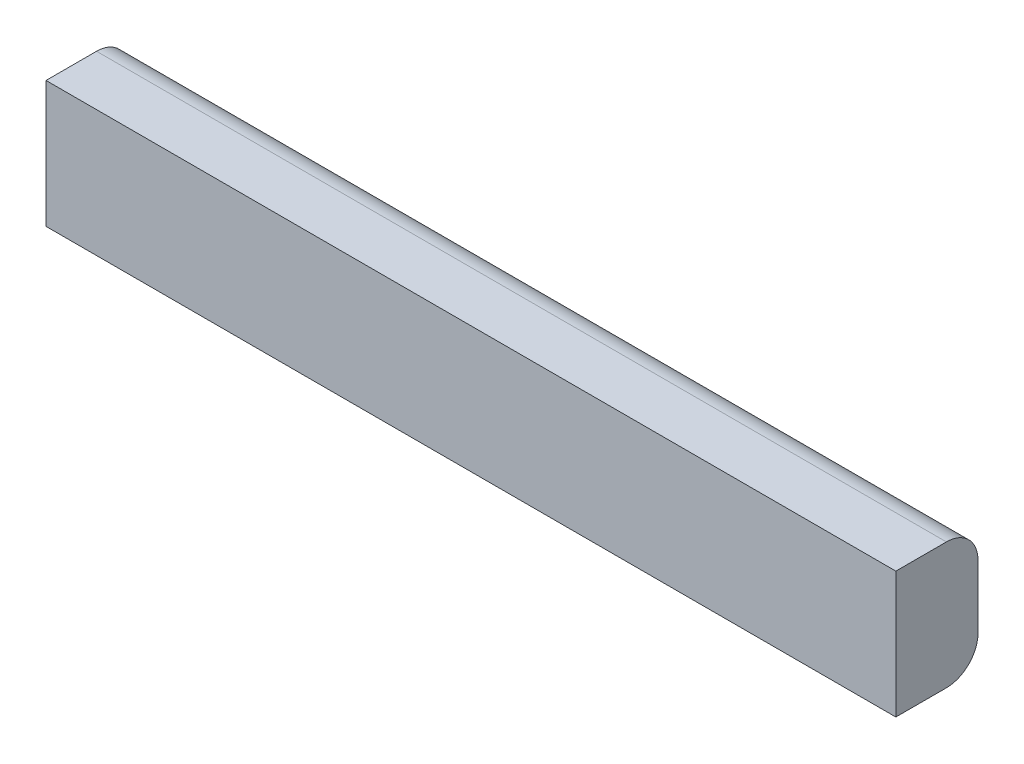
ISO-10303-21;
HEADER;
FILE_DESCRIPTION(('STEP AP214'),'2;1');
FILE_NAME('part.step','',(''),(''),'','','');
FILE_SCHEMA(('AUTOMOTIVE_DESIGN { 1 0 10303 214 1 1 1 1 }'));
ENDSEC;
DATA;
#1=APPLICATION_CONTEXT('core data for automotive mechanical design processes');
#2=APPLICATION_PROTOCOL_DEFINITION('international standard','automotive_design',2000,#1);
#3=PRODUCT_CONTEXT('',#1,'mechanical');
#4=PRODUCT('Part','Part','',(#3));
#5=PRODUCT_RELATED_PRODUCT_CATEGORY('part','',(#4));
#6=PRODUCT_DEFINITION_FORMATION('','',#4);
#7=PRODUCT_DEFINITION_CONTEXT('part definition',#1,'design');
#8=PRODUCT_DEFINITION('design','',#6,#7);
#9=PRODUCT_DEFINITION_SHAPE('','',#8);
#10=(LENGTH_UNIT() NAMED_UNIT(*) SI_UNIT(.MILLI.,.METRE.));
#11=(NAMED_UNIT(*) PLANE_ANGLE_UNIT() SI_UNIT($,.RADIAN.));
#12=(NAMED_UNIT(*) SI_UNIT($,.STERADIAN.) SOLID_ANGLE_UNIT());
#13=UNCERTAINTY_MEASURE_WITH_UNIT(LENGTH_MEASURE(1.E-05),#10,'distance_accuracy_value','');
#14=(GEOMETRIC_REPRESENTATION_CONTEXT(3) GLOBAL_UNCERTAINTY_ASSIGNED_CONTEXT((#13)) GLOBAL_UNIT_ASSIGNED_CONTEXT((#10,
#11,#12)) REPRESENTATION_CONTEXT('',''));
#15=CARTESIAN_POINT('',(0.,0.,0.));
#16=DIRECTION('',(0.,0.,1.));
#17=DIRECTION('',(1.,0.,0.));
#18=AXIS2_PLACEMENT_3D('',#15,#16,#17);
#19=CARTESIAN_POINT('',(426.974,66.0216606498195,1.42635379061369));
#20=DIRECTION('',(0.,0.,-1.));
#21=DIRECTION('',(0.,1.,0.));
#22=AXIS2_PLACEMENT_3D('',#19,#20,#21);
#23=PLANE('',#22);
#24=DIRECTION('',(0.,-1.,0.));
#25=VECTOR('',#24,1.);
#26=CARTESIAN_POINT('',(-426.974,66.0216606498195,1.42635379061369));
#27=LINE('',#26,#25);
#28=CARTESIAN_POINT('',(-426.974,66.0216606498195,1.42635379061369));
#29=VERTEX_POINT('',#28);
#30=CARTESIAN_POINT('',(-426.974,-60.9783393501805,1.42635379061368));
#31=VERTEX_POINT('',#30);
#32=EDGE_CURVE('E131',#29,#31,#27,.T.);
#33=ORIENTED_EDGE('',*,*,#32,.T.);
#34=DIRECTION('',(-1.,0.,0.));
#35=VECTOR('',#34,1.);
#36=CARTESIAN_POINT('',(426.974,-60.9783393501805,1.42635379061368));
#37=LINE('',#36,#35);
#38=CARTESIAN_POINT('',(426.974,-60.9783393501805,1.42635379061368));
#39=VERTEX_POINT('',#38);
#40=EDGE_CURVE('E11',#39,#31,#37,.T.);
#41=ORIENTED_EDGE('',*,*,#40,.F.);
#42=DIRECTION('',(0.,-1.,0.));
#43=VECTOR('',#42,1.);
#44=CARTESIAN_POINT('',(426.974,66.0216606498195,1.42635379061369));
#45=LINE('',#44,#43);
#46=CARTESIAN_POINT('',(426.974,66.0216606498195,1.42635379061369));
#47=VERTEX_POINT('',#46);
#48=EDGE_CURVE('E145',#47,#39,#45,.T.);
#49=ORIENTED_EDGE('',*,*,#48,.F.);
#50=DIRECTION('',(-1.,0.,0.));
#51=VECTOR('',#50,1.);
#52=CARTESIAN_POINT('',(426.974,66.0216606498195,1.42635379061369));
#53=LINE('',#52,#51);
#54=EDGE_CURVE('E127',#47,#29,#53,.T.);
#55=ORIENTED_EDGE('',*,*,#54,.T.);
#56=EDGE_LOOP('',(#33,#41,#49,#55));
#57=FACE_BOUND('',#56,.T.);
#58=ADVANCED_FACE('F38',(#57),#23,.F.);
#59=CARTESIAN_POINT('',(426.974,-60.9783393501805,-49.3736462093863));
#60=DIRECTION('',(0.,1.,0.));
#61=DIRECTION('',(0.,0.,1.));
#62=AXIS2_PLACEMENT_3D('',#59,#60,#61);
#63=PLANE('',#62);
#64=DIRECTION('',(0.,0.,-1.));
#65=VECTOR('',#64,1.);
#66=CARTESIAN_POINT('',(-426.974,-60.9783393501805,-49.3736462093863));
#67=LINE('',#66,#65);
#68=CARTESIAN_POINT('',(-426.974,-60.9783393501805,-49.3736462093863));
#69=VERTEX_POINT('',#68);
#70=EDGE_CURVE('E135',#31,#69,#67,.T.);
#71=ORIENTED_EDGE('',*,*,#70,.T.);
#72=DIRECTION('',(-1.,0.,0.));
#73=VECTOR('',#72,1.);
#74=CARTESIAN_POINT('',(426.974,-60.9783393501805,-49.3736462093863));
#75=LINE('',#74,#73);
#76=CARTESIAN_POINT('',(426.974,-60.9783393501805,-49.3736462093863));
#77=VERTEX_POINT('',#76);
#78=EDGE_CURVE('E47',#77,#69,#75,.T.);
#79=ORIENTED_EDGE('',*,*,#78,.F.);
#80=DIRECTION('',(0.,0.,-1.));
#81=VECTOR('',#80,1.);
#82=CARTESIAN_POINT('',(426.974,-60.9783393501805,-49.3736462093863));
#83=LINE('',#82,#81);
#84=EDGE_CURVE('E97',#39,#77,#83,.T.);
#85=ORIENTED_EDGE('',*,*,#84,.F.);
#86=ORIENTED_EDGE('',*,*,#40,.T.);
#87=EDGE_LOOP('',(#71,#79,#85,#86));
#88=FACE_BOUND('',#87,.T.);
#89=ADVANCED_FACE('F173',(#88),#63,.F.);
#90=CARTESIAN_POINT('',(426.974,-29.2283393501805,-49.3736462093863));
#91=DIRECTION('',(-1.,0.,0.));
#92=DIRECTION('',(0.,0.,1.));
#93=AXIS2_PLACEMENT_3D('',#90,#91,#92);
#94=CYLINDRICAL_SURFACE('',#93,31.75);
#95=CARTESIAN_POINT('',(-426.974,-29.2283393501805,-49.3736462093863));
#96=DIRECTION('',(1.,0.,0.));
#97=DIRECTION('',(0.,0.,1.));
#98=AXIS2_PLACEMENT_3D('',#95,#96,#97);
#99=CIRCLE('',#98,31.75);
#100=CARTESIAN_POINT('',(-426.974,-29.2283393501805,-81.1236462093863));
#101=VERTEX_POINT('',#100);
#102=EDGE_CURVE('E138',#69,#101,#99,.T.);
#103=ORIENTED_EDGE('',*,*,#102,.T.);
#104=DIRECTION('',(-1.,0.,0.));
#105=VECTOR('',#104,1.);
#106=CARTESIAN_POINT('',(426.974,-29.2283393501805,-81.1236462093863));
#107=LINE('',#106,#105);
#108=CARTESIAN_POINT('',(426.974,-29.2283393501805,-81.1236462093863));
#109=VERTEX_POINT('',#108);
#110=EDGE_CURVE('E121',#109,#101,#107,.T.);
#111=ORIENTED_EDGE('',*,*,#110,.F.);
#112=CARTESIAN_POINT('',(426.974,-29.2283393501805,-49.3736462093863));
#113=DIRECTION('',(1.,0.,0.));
#114=DIRECTION('',(0.,0.,1.));
#115=AXIS2_PLACEMENT_3D('',#112,#113,#114);
#116=CIRCLE('',#115,31.75);
#117=EDGE_CURVE('E110',#77,#109,#116,.T.);
#118=ORIENTED_EDGE('',*,*,#117,.F.);
#119=ORIENTED_EDGE('',*,*,#78,.T.);
#120=EDGE_LOOP('',(#103,#111,#118,#119));
#121=FACE_BOUND('',#120,.T.);
#122=ADVANCED_FACE('F155',(#121),#94,.T.);
#123=CARTESIAN_POINT('',(426.974,34.2716606498195,-81.1236462093863));
#124=DIRECTION('',(0.,0.,1.));
#125=DIRECTION('',(0.,-1.,0.));
#126=AXIS2_PLACEMENT_3D('',#123,#124,#125);
#127=PLANE('',#126);
#128=DIRECTION('',(0.,1.,0.));
#129=VECTOR('',#128,1.);
#130=CARTESIAN_POINT('',(-426.974,34.2716606498195,-81.1236462093863));
#131=LINE('',#130,#129);
#132=CARTESIAN_POINT('',(-426.974,34.2716606498195,-81.1236462093863));
#133=VERTEX_POINT('',#132);
#134=EDGE_CURVE('E119',#101,#133,#131,.T.);
#135=ORIENTED_EDGE('',*,*,#134,.T.);
#136=DIRECTION('',(-1.,0.,0.));
#137=VECTOR('',#136,1.);
#138=CARTESIAN_POINT('',(426.974,34.2716606498195,-81.1236462093863));
#139=LINE('',#138,#137);
#140=CARTESIAN_POINT('',(426.974,34.2716606498195,-81.1236462093863));
#141=VERTEX_POINT('',#140);
#142=EDGE_CURVE('E116',#141,#133,#139,.T.);
#143=ORIENTED_EDGE('',*,*,#142,.F.);
#144=DIRECTION('',(0.,1.,0.));
#145=VECTOR('',#144,1.);
#146=CARTESIAN_POINT('',(426.974,34.2716606498195,-81.1236462093863));
#147=LINE('',#146,#145);
#148=EDGE_CURVE('E104',#109,#141,#147,.T.);
#149=ORIENTED_EDGE('',*,*,#148,.F.);
#150=ORIENTED_EDGE('',*,*,#110,.T.);
#151=EDGE_LOOP('',(#135,#143,#149,#150));
#152=FACE_BOUND('',#151,.T.);
#153=ADVANCED_FACE('F117',(#152),#127,.F.);
#154=CARTESIAN_POINT('',(426.974,34.2716606498195,-49.3736462093863));
#155=DIRECTION('',(-1.,0.,0.));
#156=DIRECTION('',(0.,0.,1.));
#157=AXIS2_PLACEMENT_3D('',#154,#155,#156);
#158=CYLINDRICAL_SURFACE('',#157,31.75);
#159=CARTESIAN_POINT('',(-426.974,34.2716606498195,-49.3736462093863));
#160=DIRECTION('',(1.,0.,0.));
#161=DIRECTION('',(0.,0.,1.));
#162=AXIS2_PLACEMENT_3D('',#159,#160,#161);
#163=CIRCLE('',#162,31.75);
#164=CARTESIAN_POINT('',(-426.974,66.0216606498195,-49.3736462093862));
#165=VERTEX_POINT('',#164);
#166=EDGE_CURVE('E83',#133,#165,#163,.T.);
#167=ORIENTED_EDGE('',*,*,#166,.T.);
#168=DIRECTION('',(-1.,0.,0.));
#169=VECTOR('',#168,1.);
#170=CARTESIAN_POINT('',(426.974,66.0216606498195,-49.3736462093862));
#171=LINE('',#170,#169);
#172=CARTESIAN_POINT('',(426.974,66.0216606498195,-49.3736462093862));
#173=VERTEX_POINT('',#172);
#174=EDGE_CURVE('E122',#173,#165,#171,.T.);
#175=ORIENTED_EDGE('',*,*,#174,.F.);
#176=CARTESIAN_POINT('',(426.974,34.2716606498195,-49.3736462093863));
#177=DIRECTION('',(1.,0.,0.));
#178=DIRECTION('',(0.,0.,1.));
#179=AXIS2_PLACEMENT_3D('',#176,#177,#178);
#180=CIRCLE('',#179,31.75);
#181=EDGE_CURVE('E108',#141,#173,#180,.T.);
#182=ORIENTED_EDGE('',*,*,#181,.F.);
#183=ORIENTED_EDGE('',*,*,#142,.T.);
#184=EDGE_LOOP('',(#167,#175,#182,#183));
#185=FACE_BOUND('',#184,.T.);
#186=ADVANCED_FACE('F124',(#185),#158,.T.);
#187=CARTESIAN_POINT('',(426.974,66.0216606498195,-49.3736462093862));
#188=DIRECTION('',(0.,-1.,0.));
#189=DIRECTION('',(0.,0.,-1.));
#190=AXIS2_PLACEMENT_3D('',#187,#188,#189);
#191=PLANE('',#190);
#192=DIRECTION('',(0.,0.,1.));
#193=VECTOR('',#192,1.);
#194=CARTESIAN_POINT('',(-426.974,66.0216606498195,-49.3736462093862));
#195=LINE('',#194,#193);
#196=EDGE_CURVE('E89',#165,#29,#195,.T.);
#197=ORIENTED_EDGE('',*,*,#196,.T.);
#198=ORIENTED_EDGE('',*,*,#54,.F.);
#199=DIRECTION('',(0.,0.,1.));
#200=VECTOR('',#199,1.);
#201=CARTESIAN_POINT('',(426.974,66.0216606498195,-49.3736462093862));
#202=LINE('',#201,#200);
#203=EDGE_CURVE('E58',#173,#47,#202,.T.);
#204=ORIENTED_EDGE('',*,*,#203,.F.);
#205=ORIENTED_EDGE('',*,*,#174,.T.);
#206=EDGE_LOOP('',(#197,#198,#204,#205));
#207=FACE_BOUND('',#206,.T.);
#208=ADVANCED_FACE('F162',(#207),#191,.F.);
#209=CARTESIAN_POINT('',(426.974,-29.2283393501805,-49.3736462093863));
#210=DIRECTION('',(-1.,0.,0.));
#211=DIRECTION('',(0.,0.,1.));
#212=AXIS2_PLACEMENT_3D('',#209,#210,#211);
#213=PLANE('',#212);
#214=ORIENTED_EDGE('',*,*,#48,.T.);
#215=ORIENTED_EDGE('',*,*,#84,.T.);
#216=ORIENTED_EDGE('',*,*,#117,.T.);
#217=ORIENTED_EDGE('',*,*,#148,.T.);
#218=ORIENTED_EDGE('',*,*,#181,.T.);
#219=ORIENTED_EDGE('',*,*,#203,.T.);
#220=EDGE_LOOP('',(#214,#215,#216,#217,#218,#219));
#221=FACE_BOUND('',#220,.T.);
#222=ADVANCED_FACE('F106',(#221),#213,.F.);
#223=CARTESIAN_POINT('',(-426.974,-29.2283393501805,-49.3736462093863));
#224=DIRECTION('',(-1.,0.,0.));
#225=DIRECTION('',(0.,0.,1.));
#226=AXIS2_PLACEMENT_3D('',#223,#224,#225);
#227=PLANE('',#226);
#228=ORIENTED_EDGE('',*,*,#32,.F.);
#229=ORIENTED_EDGE('',*,*,#196,.F.);
#230=ORIENTED_EDGE('',*,*,#166,.F.);
#231=ORIENTED_EDGE('',*,*,#134,.F.);
#232=ORIENTED_EDGE('',*,*,#102,.F.);
#233=ORIENTED_EDGE('',*,*,#70,.F.);
#234=EDGE_LOOP('',(#228,#229,#230,#231,#232,#233));
#235=FACE_BOUND('',#234,.T.);
#236=ADVANCED_FACE('F158',(#235),#227,.T.);
#237=CLOSED_SHELL('',(#58,#89,#122,#153,#186,#208,#222,#236));
#238=MANIFOLD_SOLID_BREP('B2',#237);
#239=ADVANCED_BREP_SHAPE_REPRESENTATION('',(#18,#238),#14);
#240=SHAPE_DEFINITION_REPRESENTATION(#9,#239);
ENDSEC;
END-ISO-10303-21;
